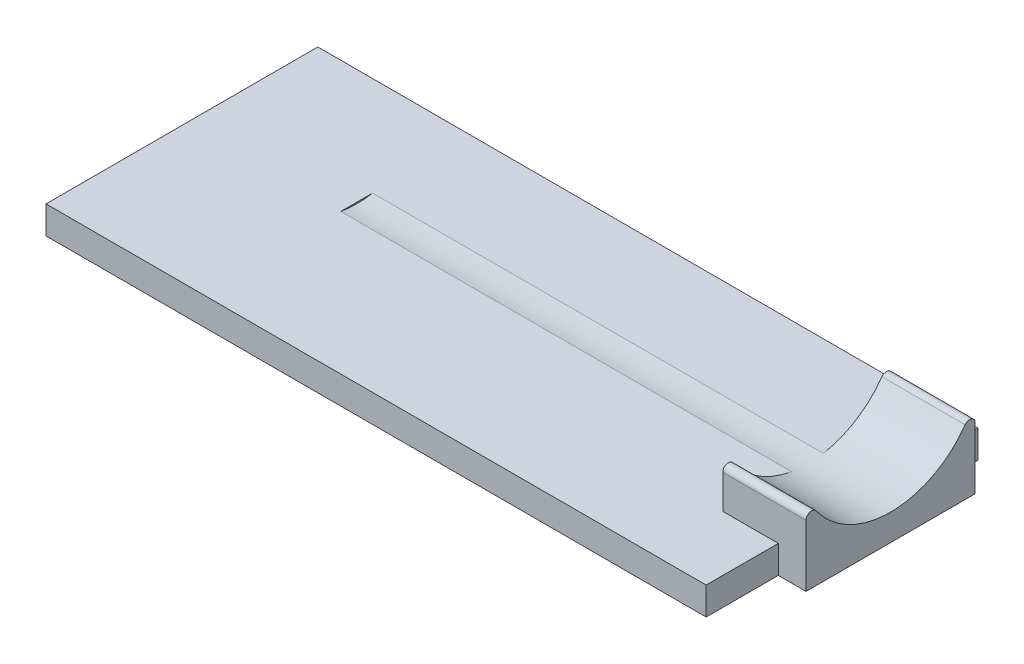
ISO-10303-21;
HEADER;
FILE_DESCRIPTION(('STEP AP214'),'2;1');
FILE_NAME('part.step','',(''),(''),'','','');
FILE_SCHEMA(('AUTOMOTIVE_DESIGN { 1 0 10303 214 1 1 1 1 }'));
ENDSEC;
DATA;
#1=APPLICATION_CONTEXT('core data for automotive mechanical design processes');
#2=APPLICATION_PROTOCOL_DEFINITION('international standard','automotive_design',2000,#1);
#3=PRODUCT_CONTEXT('',#1,'mechanical');
#4=PRODUCT('Part','Part','',(#3));
#5=PRODUCT_RELATED_PRODUCT_CATEGORY('part','',(#4));
#6=PRODUCT_DEFINITION_FORMATION('','',#4);
#7=PRODUCT_DEFINITION_CONTEXT('part definition',#1,'design');
#8=PRODUCT_DEFINITION('design','',#6,#7);
#9=PRODUCT_DEFINITION_SHAPE('','',#8);
#10=(LENGTH_UNIT() NAMED_UNIT(*) SI_UNIT(.MILLI.,.METRE.));
#11=(NAMED_UNIT(*) PLANE_ANGLE_UNIT() SI_UNIT($,.RADIAN.));
#12=(NAMED_UNIT(*) SI_UNIT($,.STERADIAN.) SOLID_ANGLE_UNIT());
#13=UNCERTAINTY_MEASURE_WITH_UNIT(LENGTH_MEASURE(1.E-05),#10,'distance_accuracy_value','');
#14=(GEOMETRIC_REPRESENTATION_CONTEXT(3) GLOBAL_UNCERTAINTY_ASSIGNED_CONTEXT((#13)) GLOBAL_UNIT_ASSIGNED_CONTEXT((#10,
#11,#12)) REPRESENTATION_CONTEXT('',''));
#15=CARTESIAN_POINT('',(0.,0.,0.));
#16=DIRECTION('',(0.,0.,1.));
#17=DIRECTION('',(1.,0.,0.));
#18=AXIS2_PLACEMENT_3D('',#15,#16,#17);
#19=CARTESIAN_POINT('',(-2.,4.25,-2.6));
#20=DIRECTION('',(1.,0.,0.));
#21=DIRECTION('',(0.,0.,-1.));
#22=AXIS2_PLACEMENT_3D('',#19,#20,#21);
#23=PLANE('',#22);
#24=DIRECTION('',(0.,-1.,0.));
#25=VECTOR('',#24,1.);
#26=CARTESIAN_POINT('',(-2.,4.25,-2.6));
#27=LINE('',#26,#25);
#28=CARTESIAN_POINT('',(-2.,2.218375034609,-2.6));
#29=VERTEX_POINT('',#28);
#30=CARTESIAN_POINT('',(-2.,1.,-2.6));
#31=VERTEX_POINT('',#30);
#32=EDGE_CURVE('E190',#29,#31,#27,.T.);
#33=ORIENTED_EDGE('',*,*,#32,.F.);
#34=CARTESIAN_POINT('',(-2.,2.21837503460899,-2.8));
#35=DIRECTION('',(1.,0.,0.));
#36=DIRECTION('',(0.,0.,-1.));
#37=AXIS2_PLACEMENT_3D('',#34,#35,#36);
#38=CIRCLE('',#37,0.2);
#39=CARTESIAN_POINT('',(-2.,2.3344678897742,-2.96285714285715));
#40=VERTEX_POINT('',#39);
#41=EDGE_CURVE('E11',#29,#40,#38,.F.);
#42=ORIENTED_EDGE('',*,*,#41,.T.);
#43=CARTESIAN_POINT('',(-2.,4.25,-5.65));
#44=DIRECTION('',(1.,0.,0.));
#45=DIRECTION('',(0.,0.,-1.));
#46=AXIS2_PLACEMENT_3D('',#43,#44,#45);
#47=CIRCLE('',#46,3.3);
#48=CARTESIAN_POINT('',(-2.,1.,-5.07772384288703));
#49=VERTEX_POINT('',#48);
#50=EDGE_CURVE('E154',#40,#49,#47,.T.);
#51=ORIENTED_EDGE('',*,*,#50,.T.);
#52=DIRECTION('',(0.,0.,1.));
#53=VECTOR('',#52,1.);
#54=CARTESIAN_POINT('',(-2.,1.,-2.6));
#55=LINE('',#54,#53);
#56=EDGE_CURVE('E160',#49,#31,#55,.T.);
#57=ORIENTED_EDGE('',*,*,#56,.T.);
#58=EDGE_LOOP('',(#33,#42,#51,#57));
#59=FACE_BOUND('',#58,.T.);
#60=ADVANCED_FACE('F37',(#59),#23,.F.);
#61=CARTESIAN_POINT('',(0.,1.,0.));
#62=DIRECTION('',(-1.,0.,0.));
#63=DIRECTION('',(0.,0.,1.));
#64=AXIS2_PLACEMENT_3D('',#61,#62,#63);
#65=PLANE('',#64);
#66=DIRECTION('',(0.,1.,0.));
#67=VECTOR('',#66,1.);
#68=CARTESIAN_POINT('',(0.,-6.18142378421024,-2.6));
#69=LINE('',#68,#67);
#70=CARTESIAN_POINT('',(0.,0.,-2.6));
#71=VERTEX_POINT('',#70);
#72=CARTESIAN_POINT('',(0.,1.,-2.6));
#73=VERTEX_POINT('',#72);
#74=EDGE_CURVE('E167',#71,#73,#69,.T.);
#75=ORIENTED_EDGE('',*,*,#74,.T.);
#76=DIRECTION('',(0.,0.,-1.));
#77=VECTOR('',#76,1.);
#78=CARTESIAN_POINT('',(0.,1.,0.));
#79=LINE('',#78,#77);
#80=CARTESIAN_POINT('',(0.,1.,0.));
#81=VERTEX_POINT('',#80);
#82=EDGE_CURVE('E197',#81,#73,#79,.T.);
#83=ORIENTED_EDGE('',*,*,#82,.F.);
#84=DIRECTION('',(0.,-1.,0.));
#85=VECTOR('',#84,1.);
#86=CARTESIAN_POINT('',(0.,1.,0.));
#87=LINE('',#86,#85);
#88=CARTESIAN_POINT('',(0.,0.,0.));
#89=VERTEX_POINT('',#88);
#90=EDGE_CURVE('E207',#81,#89,#87,.T.);
#91=ORIENTED_EDGE('',*,*,#90,.T.);
#92=DIRECTION('',(0.,0.,-1.));
#93=VECTOR('',#92,1.);
#94=CARTESIAN_POINT('',(0.,0.,0.));
#95=LINE('',#94,#93);
#96=EDGE_CURVE('E208',#89,#71,#95,.T.);
#97=ORIENTED_EDGE('',*,*,#96,.T.);
#98=EDGE_LOOP('',(#75,#83,#91,#97));
#99=FACE_BOUND('',#98,.T.);
#100=ADVANCED_FACE('F247',(#99),#65,.F.);
#101=DIRECTION('',(0.,1.,0.));
#102=VECTOR('',#101,1.);
#103=CARTESIAN_POINT('',(0.,-6.18142378421024,-8.7));
#104=LINE('',#103,#102);
#105=CARTESIAN_POINT('',(0.,0.,-8.7));
#106=VERTEX_POINT('',#105);
#107=CARTESIAN_POINT('',(0.,1.,-8.7));
#108=VERTEX_POINT('',#107);
#109=EDGE_CURVE('E175',#106,#108,#104,.T.);
#110=ORIENTED_EDGE('',*,*,#109,.F.);
#111=CARTESIAN_POINT('',(0.,0.,-9.8));
#112=VERTEX_POINT('',#111);
#113=EDGE_CURVE('E196',#106,#112,#95,.T.);
#114=ORIENTED_EDGE('',*,*,#113,.T.);
#115=DIRECTION('',(0.,-1.,0.));
#116=VECTOR('',#115,1.);
#117=CARTESIAN_POINT('',(0.,1.,-9.8));
#118=LINE('',#117,#116);
#119=CARTESIAN_POINT('',(0.,1.,-9.8));
#120=VERTEX_POINT('',#119);
#121=EDGE_CURVE('E181',#120,#112,#118,.T.);
#122=ORIENTED_EDGE('',*,*,#121,.F.);
#123=EDGE_CURVE('E201',#108,#120,#79,.T.);
#124=ORIENTED_EDGE('',*,*,#123,.F.);
#125=EDGE_LOOP('',(#110,#114,#122,#124));
#126=FACE_BOUND('',#125,.T.);
#127=ADVANCED_FACE('F276',(#126),#65,.F.);
#128=CARTESIAN_POINT('',(0.,1.,-9.8));
#129=DIRECTION('',(0.,0.,1.));
#130=DIRECTION('',(1.,0.,0.));
#131=AXIS2_PLACEMENT_3D('',#128,#129,#130);
#132=PLANE('',#131);
#133=DIRECTION('',(-1.,0.,0.));
#134=VECTOR('',#133,1.);
#135=CARTESIAN_POINT('',(0.,0.,-9.8));
#136=LINE('',#135,#134);
#137=CARTESIAN_POINT('',(-23.8,0.,-9.8));
#138=VERTEX_POINT('',#137);
#139=EDGE_CURVE('E211',#112,#138,#136,.T.);
#140=ORIENTED_EDGE('',*,*,#139,.T.);
#141=DIRECTION('',(0.,-1.,0.));
#142=VECTOR('',#141,1.);
#143=CARTESIAN_POINT('',(-23.8,1.,-9.8));
#144=LINE('',#143,#142);
#145=CARTESIAN_POINT('',(-23.8,1.,-9.8));
#146=VERTEX_POINT('',#145);
#147=EDGE_CURVE('E222',#146,#138,#144,.T.);
#148=ORIENTED_EDGE('',*,*,#147,.F.);
#149=DIRECTION('',(-1.,0.,0.));
#150=VECTOR('',#149,1.);
#151=CARTESIAN_POINT('',(0.,1.,-9.8));
#152=LINE('',#151,#150);
#153=EDGE_CURVE('E200',#120,#146,#152,.T.);
#154=ORIENTED_EDGE('',*,*,#153,.F.);
#155=ORIENTED_EDGE('',*,*,#121,.T.);
#156=EDGE_LOOP('',(#140,#148,#154,#155));
#157=FACE_BOUND('',#156,.T.);
#158=ADVANCED_FACE('F279',(#157),#132,.F.);
#159=CARTESIAN_POINT('',(-23.8,1.,0.));
#160=DIRECTION('',(1.,0.,0.));
#161=DIRECTION('',(0.,0.,-1.));
#162=AXIS2_PLACEMENT_3D('',#159,#160,#161);
#163=PLANE('',#162);
#164=DIRECTION('',(0.,0.,1.));
#165=VECTOR('',#164,1.);
#166=CARTESIAN_POINT('',(-23.8,0.,0.));
#167=LINE('',#166,#165);
#168=CARTESIAN_POINT('',(-23.8,0.,0.));
#169=VERTEX_POINT('',#168);
#170=EDGE_CURVE('E213',#138,#169,#167,.T.);
#171=ORIENTED_EDGE('',*,*,#170,.T.);
#172=DIRECTION('',(0.,-1.,0.));
#173=VECTOR('',#172,1.);
#174=CARTESIAN_POINT('',(-23.8,1.,0.));
#175=LINE('',#174,#173);
#176=CARTESIAN_POINT('',(-23.8,1.,0.));
#177=VERTEX_POINT('',#176);
#178=EDGE_CURVE('E219',#177,#169,#175,.T.);
#179=ORIENTED_EDGE('',*,*,#178,.F.);
#180=DIRECTION('',(0.,0.,1.));
#181=VECTOR('',#180,1.);
#182=CARTESIAN_POINT('',(-23.8,1.,0.));
#183=LINE('',#182,#181);
#184=EDGE_CURVE('E203',#146,#177,#183,.T.);
#185=ORIENTED_EDGE('',*,*,#184,.F.);
#186=ORIENTED_EDGE('',*,*,#147,.T.);
#187=EDGE_LOOP('',(#171,#179,#185,#186));
#188=FACE_BOUND('',#187,.T.);
#189=ADVANCED_FACE('F285',(#188),#163,.F.);
#190=CARTESIAN_POINT('',(0.,1.,0.));
#191=DIRECTION('',(0.,0.,-1.));
#192=DIRECTION('',(-1.,0.,0.));
#193=AXIS2_PLACEMENT_3D('',#190,#191,#192);
#194=PLANE('',#193);
#195=DIRECTION('',(1.,0.,0.));
#196=VECTOR('',#195,1.);
#197=CARTESIAN_POINT('',(0.,0.,0.));
#198=LINE('',#197,#196);
#199=EDGE_CURVE('E215',#169,#89,#198,.T.);
#200=ORIENTED_EDGE('',*,*,#199,.T.);
#201=ORIENTED_EDGE('',*,*,#90,.F.);
#202=DIRECTION('',(1.,0.,0.));
#203=VECTOR('',#202,1.);
#204=CARTESIAN_POINT('',(0.,1.,0.));
#205=LINE('',#204,#203);
#206=EDGE_CURVE('E205',#177,#81,#205,.T.);
#207=ORIENTED_EDGE('',*,*,#206,.F.);
#208=ORIENTED_EDGE('',*,*,#178,.T.);
#209=EDGE_LOOP('',(#200,#201,#207,#208));
#210=FACE_BOUND('',#209,.T.);
#211=ADVANCED_FACE('F287',(#210),#194,.F.);
#212=CARTESIAN_POINT('',(0.,1.,0.));
#213=DIRECTION('',(0.,1.,0.));
#214=DIRECTION('',(0.,0.,1.));
#215=AXIS2_PLACEMENT_3D('',#212,#213,#214);
#216=PLANE('',#215);
#217=DIRECTION('',(1.,0.,0.));
#218=VECTOR('',#217,1.);
#219=CARTESIAN_POINT('',(-18.25,1.,-5.07772384288703));
#220=LINE('',#219,#218);
#221=CARTESIAN_POINT('',(-18.25,1.,-5.07772384288703));
#222=VERTEX_POINT('',#221);
#223=EDGE_CURVE('E151',#222,#49,#220,.T.);
#224=ORIENTED_EDGE('',*,*,#223,.F.);
#225=DIRECTION('',(0.,0.,-1.));
#226=VECTOR('',#225,1.);
#227=CARTESIAN_POINT('',(-18.25,1.,0.));
#228=LINE('',#227,#226);
#229=CARTESIAN_POINT('',(-18.25,1.,-6.22227615711297));
#230=VERTEX_POINT('',#229);
#231=EDGE_CURVE('E138',#222,#230,#228,.T.);
#232=ORIENTED_EDGE('',*,*,#231,.T.);
#233=DIRECTION('',(1.,0.,0.));
#234=VECTOR('',#233,1.);
#235=CARTESIAN_POINT('',(-18.25,1.,-6.22227615711297));
#236=LINE('',#235,#234);
#237=CARTESIAN_POINT('',(-2.,1.,-6.22227615711297));
#238=VERTEX_POINT('',#237);
#239=EDGE_CURVE('E153',#238,#230,#236,.F.);
#240=ORIENTED_EDGE('',*,*,#239,.F.);
#241=CARTESIAN_POINT('',(-2.,1.,-8.7));
#242=VERTEX_POINT('',#241);
#243=EDGE_CURVE('E182',#242,#238,#55,.T.);
#244=ORIENTED_EDGE('',*,*,#243,.F.);
#245=DIRECTION('',(-1.,0.,0.));
#246=VECTOR('',#245,1.);
#247=CARTESIAN_POINT('',(-2.,1.,-8.7));
#248=LINE('',#247,#246);
#249=EDGE_CURVE('E146',#108,#242,#248,.T.);
#250=ORIENTED_EDGE('',*,*,#249,.F.);
#251=ORIENTED_EDGE('',*,*,#123,.T.);
#252=ORIENTED_EDGE('',*,*,#153,.T.);
#253=ORIENTED_EDGE('',*,*,#184,.T.);
#254=ORIENTED_EDGE('',*,*,#206,.T.);
#255=ORIENTED_EDGE('',*,*,#82,.T.);
#256=DIRECTION('',(1.,0.,0.));
#257=VECTOR('',#256,1.);
#258=CARTESIAN_POINT('',(1.,1.,-2.6));
#259=LINE('',#258,#257);
#260=EDGE_CURVE('E185',#31,#73,#259,.T.);
#261=ORIENTED_EDGE('',*,*,#260,.F.);
#262=ORIENTED_EDGE('',*,*,#56,.F.);
#263=EDGE_LOOP('',(#224,#232,#240,#244,#250,#251,#252,#253,#254,#255,#261,#262));
#264=FACE_BOUND('',#263,.T.);
#265=ADVANCED_FACE('F157',(#264),#216,.T.);
#266=CARTESIAN_POINT('',(0.,0.,0.));
#267=DIRECTION('',(0.,1.,0.));
#268=DIRECTION('',(0.,0.,1.));
#269=AXIS2_PLACEMENT_3D('',#266,#267,#268);
#270=PLANE('',#269);
#271=ORIENTED_EDGE('',*,*,#96,.F.);
#272=ORIENTED_EDGE('',*,*,#199,.F.);
#273=ORIENTED_EDGE('',*,*,#170,.F.);
#274=ORIENTED_EDGE('',*,*,#139,.F.);
#275=ORIENTED_EDGE('',*,*,#113,.F.);
#276=DIRECTION('',(-1.,0.,0.));
#277=VECTOR('',#276,1.);
#278=CARTESIAN_POINT('',(0.,0.,-8.7));
#279=LINE('',#278,#277);
#280=CARTESIAN_POINT('',(1.,0.,-8.7));
#281=VERTEX_POINT('',#280);
#282=EDGE_CURVE('E171',#281,#106,#279,.T.);
#283=ORIENTED_EDGE('',*,*,#282,.F.);
#284=DIRECTION('',(0.,0.,-1.));
#285=VECTOR('',#284,1.);
#286=CARTESIAN_POINT('',(0.999999999999999,0.,-2.6));
#287=LINE('',#286,#285);
#288=CARTESIAN_POINT('',(0.999999999999999,0.,-2.6));
#289=VERTEX_POINT('',#288);
#290=EDGE_CURVE('E168',#289,#281,#287,.T.);
#291=ORIENTED_EDGE('',*,*,#290,.F.);
#292=DIRECTION('',(1.,0.,0.));
#293=VECTOR('',#292,1.);
#294=CARTESIAN_POINT('',(0.,0.,-2.6));
#295=LINE('',#294,#293);
#296=EDGE_CURVE('E172',#71,#289,#295,.T.);
#297=ORIENTED_EDGE('',*,*,#296,.F.);
#298=EDGE_LOOP('',(#271,#272,#273,#274,#275,#283,#291,#297));
#299=FACE_BOUND('',#298,.T.);
#300=ADVANCED_FACE('F251',(#299),#270,.F.);
#301=CARTESIAN_POINT('',(1.,4.25,-8.7));
#302=DIRECTION('',(-1.,0.,0.));
#303=DIRECTION('',(0.,0.,1.));
#304=AXIS2_PLACEMENT_3D('',#301,#302,#303);
#305=PLANE('',#304);
#306=DIRECTION('',(0.,-1.,0.));
#307=VECTOR('',#306,1.);
#308=CARTESIAN_POINT('',(1.,4.25,-8.7));
#309=LINE('',#308,#307);
#310=CARTESIAN_POINT('',(1.,2.21837503460899,-8.7));
#311=VERTEX_POINT('',#310);
#312=EDGE_CURVE('E194',#311,#281,#309,.T.);
#313=ORIENTED_EDGE('',*,*,#312,.F.);
#314=CARTESIAN_POINT('',(1.,2.21837503460898,-8.49999999999999));
#315=DIRECTION('',(-1.,0.,0.));
#316=DIRECTION('',(0.,0.,1.));
#317=AXIS2_PLACEMENT_3D('',#314,#315,#316);
#318=CIRCLE('',#317,0.2);
#319=CARTESIAN_POINT('',(1.,2.33446788977418,-8.33714285714285));
#320=VERTEX_POINT('',#319);
#321=EDGE_CURVE('E231',#311,#320,#318,.F.);
#322=ORIENTED_EDGE('',*,*,#321,.T.);
#323=CARTESIAN_POINT('',(1.,4.25,-5.65));
#324=DIRECTION('',(1.,0.,0.));
#325=DIRECTION('',(0.,0.,-1.));
#326=AXIS2_PLACEMENT_3D('',#323,#324,#325);
#327=CIRCLE('',#326,3.3);
#328=CARTESIAN_POINT('',(1.,2.3344678897742,-2.96285714285715));
#329=VERTEX_POINT('',#328);
#330=EDGE_CURVE('E155',#329,#320,#327,.T.);
#331=ORIENTED_EDGE('',*,*,#330,.F.);
#332=CARTESIAN_POINT('',(1.,2.21837503460899,-2.8));
#333=DIRECTION('',(-1.,0.,0.));
#334=DIRECTION('',(0.,0.,1.));
#335=AXIS2_PLACEMENT_3D('',#332,#333,#334);
#336=CIRCLE('',#335,0.2);
#337=CARTESIAN_POINT('',(1.,2.218375034609,-2.6));
#338=VERTEX_POINT('',#337);
#339=EDGE_CURVE('E229',#329,#338,#336,.F.);
#340=ORIENTED_EDGE('',*,*,#339,.T.);
#341=DIRECTION('',(0.,-1.,0.));
#342=VECTOR('',#341,1.);
#343=CARTESIAN_POINT('',(1.,4.25,-2.6));
#344=LINE('',#343,#342);
#345=EDGE_CURVE('E188',#338,#289,#344,.T.);
#346=ORIENTED_EDGE('',*,*,#345,.T.);
#347=ORIENTED_EDGE('',*,*,#290,.T.);
#348=EDGE_LOOP('',(#313,#322,#331,#340,#346,#347));
#349=FACE_BOUND('',#348,.T.);
#350=ADVANCED_FACE('F258',(#349),#305,.F.);
#351=CARTESIAN_POINT('',(-2.,4.25,-8.7));
#352=DIRECTION('',(0.,0.,1.));
#353=DIRECTION('',(1.,0.,0.));
#354=AXIS2_PLACEMENT_3D('',#351,#352,#353);
#355=PLANE('',#354);
#356=DIRECTION('',(0.,-1.,0.));
#357=VECTOR('',#356,1.);
#358=CARTESIAN_POINT('',(-2.,4.25,-8.7));
#359=LINE('',#358,#357);
#360=CARTESIAN_POINT('',(-2.,2.21837503460899,-8.7));
#361=VERTEX_POINT('',#360);
#362=EDGE_CURVE('E192',#361,#242,#359,.T.);
#363=ORIENTED_EDGE('',*,*,#362,.F.);
#364=DIRECTION('',(1.,0.,0.));
#365=VECTOR('',#364,1.);
#366=CARTESIAN_POINT('',(-2.,2.21837503460898,-8.7));
#367=LINE('',#366,#365);
#368=EDGE_CURVE('E145',#361,#311,#367,.T.);
#369=ORIENTED_EDGE('',*,*,#368,.T.);
#370=ORIENTED_EDGE('',*,*,#312,.T.);
#371=ORIENTED_EDGE('',*,*,#282,.T.);
#372=ORIENTED_EDGE('',*,*,#109,.T.);
#373=ORIENTED_EDGE('',*,*,#249,.T.);
#374=EDGE_LOOP('',(#363,#369,#370,#371,#372,#373));
#375=FACE_BOUND('',#374,.T.);
#376=ADVANCED_FACE('F269',(#375),#355,.F.);
#377=CARTESIAN_POINT('',(-2.,2.33446788977418,-8.33714285714285));
#378=VERTEX_POINT('',#377);
#379=EDGE_CURVE('E161',#238,#378,#47,.T.);
#380=ORIENTED_EDGE('',*,*,#379,.T.);
#381=CARTESIAN_POINT('',(-2.,2.21837503460898,-8.49999999999999));
#382=DIRECTION('',(1.,0.,0.));
#383=DIRECTION('',(0.,0.,-1.));
#384=AXIS2_PLACEMENT_3D('',#381,#382,#383);
#385=CIRCLE('',#384,0.2);
#386=EDGE_CURVE('E236',#378,#361,#385,.F.);
#387=ORIENTED_EDGE('',*,*,#386,.T.);
#388=ORIENTED_EDGE('',*,*,#362,.T.);
#389=ORIENTED_EDGE('',*,*,#243,.T.);
#390=EDGE_LOOP('',(#380,#387,#388,#389));
#391=FACE_BOUND('',#390,.T.);
#392=ADVANCED_FACE('F266',(#391),#23,.F.);
#393=CARTESIAN_POINT('',(1.,4.25,-2.6));
#394=DIRECTION('',(0.,0.,-1.));
#395=DIRECTION('',(-1.,0.,0.));
#396=AXIS2_PLACEMENT_3D('',#393,#394,#395);
#397=PLANE('',#396);
#398=ORIENTED_EDGE('',*,*,#345,.F.);
#399=DIRECTION('',(1.,0.,0.));
#400=VECTOR('',#399,1.);
#401=CARTESIAN_POINT('',(1.,2.21837503460899,-2.6));
#402=LINE('',#401,#400);
#403=EDGE_CURVE('E45',#338,#29,#402,.F.);
#404=ORIENTED_EDGE('',*,*,#403,.T.);
#405=ORIENTED_EDGE('',*,*,#32,.T.);
#406=ORIENTED_EDGE('',*,*,#260,.T.);
#407=ORIENTED_EDGE('',*,*,#74,.F.);
#408=ORIENTED_EDGE('',*,*,#296,.T.);
#409=EDGE_LOOP('',(#398,#404,#405,#406,#407,#408));
#410=FACE_BOUND('',#409,.T.);
#411=ADVANCED_FACE('F240',(#410),#397,.F.);
#412=CARTESIAN_POINT('',(-18.25,4.25,-5.65));
#413=DIRECTION('',(1.,0.,0.));
#414=DIRECTION('',(0.,0.,-1.));
#415=AXIS2_PLACEMENT_3D('',#412,#413,#414);
#416=CYLINDRICAL_SURFACE('',#415,3.3);
#417=ORIENTED_EDGE('',*,*,#330,.T.);
#418=DIRECTION('',(1.,0.,0.));
#419=VECTOR('',#418,1.);
#420=CARTESIAN_POINT('',(-18.25,2.33446788977418,-8.33714285714285));
#421=LINE('',#420,#419);
#422=EDGE_CURVE('E58',#320,#378,#421,.F.);
#423=ORIENTED_EDGE('',*,*,#422,.T.);
#424=ORIENTED_EDGE('',*,*,#379,.F.);
#425=ORIENTED_EDGE('',*,*,#239,.T.);
#426=CARTESIAN_POINT('',(-18.25,4.25,-5.65));
#427=DIRECTION('',(1.,0.,0.));
#428=DIRECTION('',(0.,0.,-1.));
#429=AXIS2_PLACEMENT_3D('',#426,#427,#428);
#430=CIRCLE('',#429,3.3);
#431=EDGE_CURVE('E141',#222,#230,#430,.T.);
#432=ORIENTED_EDGE('',*,*,#431,.F.);
#433=ORIENTED_EDGE('',*,*,#223,.T.);
#434=ORIENTED_EDGE('',*,*,#50,.F.);
#435=DIRECTION('',(1.,0.,0.));
#436=VECTOR('',#435,1.);
#437=CARTESIAN_POINT('',(-18.25,2.3344678897742,-2.96285714285714));
#438=LINE('',#437,#436);
#439=EDGE_CURVE('E233',#40,#329,#438,.T.);
#440=ORIENTED_EDGE('',*,*,#439,.T.);
#441=EDGE_LOOP('',(#417,#423,#424,#425,#432,#433,#434,#440));
#442=FACE_BOUND('',#441,.T.);
#443=ADVANCED_FACE('F149',(#442),#416,.F.);
#444=CARTESIAN_POINT('',(-18.25,4.25,-5.65));
#445=DIRECTION('',(1.,0.,0.));
#446=DIRECTION('',(0.,0.,-1.));
#447=AXIS2_PLACEMENT_3D('',#444,#445,#446);
#448=PLANE('',#447);
#449=ORIENTED_EDGE('',*,*,#431,.T.);
#450=ORIENTED_EDGE('',*,*,#231,.F.);
#451=EDGE_LOOP('',(#449,#450));
#452=FACE_BOUND('',#451,.T.);
#453=ADVANCED_FACE('F140',(#452),#448,.T.);
#454=CARTESIAN_POINT('',(-18.25,2.21837503460898,-8.49999999999999));
#455=DIRECTION('',(1.,0.,0.));
#456=DIRECTION('',(0.,0.,-1.));
#457=AXIS2_PLACEMENT_3D('',#454,#455,#456);
#458=CYLINDRICAL_SURFACE('',#457,0.2);
#459=ORIENTED_EDGE('',*,*,#386,.F.);
#460=ORIENTED_EDGE('',*,*,#422,.F.);
#461=ORIENTED_EDGE('',*,*,#321,.F.);
#462=ORIENTED_EDGE('',*,*,#368,.F.);
#463=EDGE_LOOP('',(#459,#460,#461,#462));
#464=FACE_BOUND('',#463,.T.);
#465=ADVANCED_FACE('F262',(#464),#458,.T.);
#466=CARTESIAN_POINT('',(-18.25,2.21837503460899,-2.8));
#467=DIRECTION('',(1.,0.,0.));
#468=DIRECTION('',(0.,0.,-1.));
#469=AXIS2_PLACEMENT_3D('',#466,#467,#468);
#470=CYLINDRICAL_SURFACE('',#469,0.2);
#471=ORIENTED_EDGE('',*,*,#339,.F.);
#472=ORIENTED_EDGE('',*,*,#439,.F.);
#473=ORIENTED_EDGE('',*,*,#41,.F.);
#474=ORIENTED_EDGE('',*,*,#403,.F.);
#475=EDGE_LOOP('',(#471,#472,#473,#474));
#476=FACE_BOUND('',#475,.T.);
#477=ADVANCED_FACE('F39',(#476),#470,.T.);
#478=CLOSED_SHELL('',(#60,#100,#127,#158,#189,#211,#265,#300,#350,#376,#392,#411,#443,#453,#465,#477));
#479=MANIFOLD_SOLID_BREP('B2',#478);
#480=ADVANCED_BREP_SHAPE_REPRESENTATION('',(#18,#479),#14);
#481=SHAPE_DEFINITION_REPRESENTATION(#9,#480);
ENDSEC;
END-ISO-10303-21;
